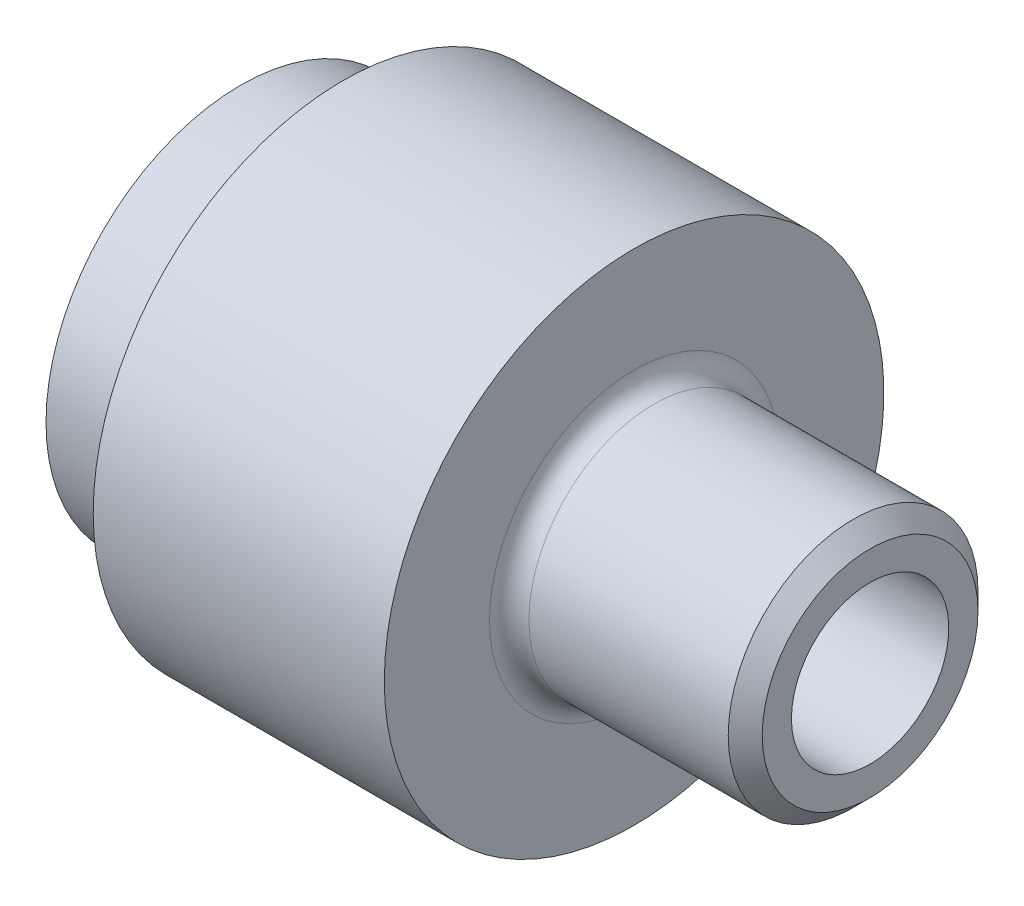
ISO-10303-21;
HEADER;
FILE_DESCRIPTION(('STEP AP214'),'2;1');
FILE_NAME('part.step','',(''),(''),'','','');
FILE_SCHEMA(('AUTOMOTIVE_DESIGN { 1 0 10303 214 1 1 1 1 }'));
ENDSEC;
DATA;
#1=APPLICATION_CONTEXT('core data for automotive mechanical design processes');
#2=APPLICATION_PROTOCOL_DEFINITION('international standard','automotive_design',2000,#1);
#3=PRODUCT_CONTEXT('',#1,'mechanical');
#4=PRODUCT('Part','Part','',(#3));
#5=PRODUCT_RELATED_PRODUCT_CATEGORY('part','',(#4));
#6=PRODUCT_DEFINITION_FORMATION('','',#4);
#7=PRODUCT_DEFINITION_CONTEXT('part definition',#1,'design');
#8=PRODUCT_DEFINITION('design','',#6,#7);
#9=PRODUCT_DEFINITION_SHAPE('','',#8);
#10=(LENGTH_UNIT() NAMED_UNIT(*) SI_UNIT(.MILLI.,.METRE.));
#11=(NAMED_UNIT(*) PLANE_ANGLE_UNIT() SI_UNIT($,.RADIAN.));
#12=(NAMED_UNIT(*) SI_UNIT($,.STERADIAN.) SOLID_ANGLE_UNIT());
#13=UNCERTAINTY_MEASURE_WITH_UNIT(LENGTH_MEASURE(1.E-05),#10,'distance_accuracy_value','');
#14=(GEOMETRIC_REPRESENTATION_CONTEXT(3) GLOBAL_UNCERTAINTY_ASSIGNED_CONTEXT((#13)) GLOBAL_UNIT_ASSIGNED_CONTEXT((#10,
#11,#12)) REPRESENTATION_CONTEXT('',''));
#15=CARTESIAN_POINT('',(0.,0.,0.));
#16=DIRECTION('',(0.,0.,1.));
#17=DIRECTION('',(1.,0.,0.));
#18=AXIS2_PLACEMENT_3D('',#15,#16,#17);
#19=CARTESIAN_POINT('',(39.195945945946,10.,0.));
#20=DIRECTION('',(-1.,0.,0.));
#21=DIRECTION('',(0.,0.,1.));
#22=AXIS2_PLACEMENT_3D('',#19,#20,#21);
#23=PLANE('',#22);
#24=CARTESIAN_POINT('',(39.195945945946,0.,0.));
#25=DIRECTION('',(-1.,0.,0.));
#26=DIRECTION('',(0.,0.,1.));
#27=AXIS2_PLACEMENT_3D('',#24,#25,#26);
#28=CIRCLE('',#27,10.);
#29=CARTESIAN_POINT('',(39.195945945946,0.,10.));
#30=VERTEX_POINT('',#29);
#31=EDGE_CURVE('E77',#30,#30,#28,.T.);
#32=ORIENTED_EDGE('',*,*,#31,.T.);
#33=EDGE_LOOP('',(#32));
#34=FACE_BOUND('',#33,.T.);
#35=CARTESIAN_POINT('',(39.195945945946,0.,0.));
#36=DIRECTION('',(-1.,0.,0.));
#37=DIRECTION('',(0.,0.,1.));
#38=AXIS2_PLACEMENT_3D('',#35,#36,#37);
#39=CIRCLE('',#38,13.71473);
#40=CARTESIAN_POINT('',(39.195945945946,0.,13.71473));
#41=VERTEX_POINT('',#40);
#42=EDGE_CURVE('E85',#41,#41,#39,.T.);
#43=ORIENTED_EDGE('',*,*,#42,.F.);
#44=EDGE_LOOP('',(#43));
#45=FACE_BOUND('',#44,.T.);
#46=ADVANCED_FACE('F45',(#34,#45),#23,.F.);
#47=CARTESIAN_POINT('',(-40.804054054054,10.,0.));
#48=DIRECTION('',(1.,0.,0.));
#49=DIRECTION('',(0.,0.,-1.));
#50=AXIS2_PLACEMENT_3D('',#47,#48,#49);
#51=PLANE('',#50);
#52=CARTESIAN_POINT('',(-40.804054054054,0.,0.));
#53=DIRECTION('',(-1.,0.,0.));
#54=DIRECTION('',(0.,0.,1.));
#55=AXIS2_PLACEMENT_3D('',#52,#53,#54);
#56=CIRCLE('',#55,10.);
#57=CARTESIAN_POINT('',(-40.804054054054,0.,10.));
#58=VERTEX_POINT('',#57);
#59=EDGE_CURVE('E81',#58,#58,#56,.T.);
#60=ORIENTED_EDGE('',*,*,#59,.F.);
#61=EDGE_LOOP('',(#60));
#62=FACE_BOUND('',#61,.T.);
#63=CARTESIAN_POINT('',(-40.804054054054,0.,0.));
#64=DIRECTION('',(-1.,0.,0.));
#65=DIRECTION('',(0.,0.,1.));
#66=AXIS2_PLACEMENT_3D('',#63,#64,#65);
#67=CIRCLE('',#66,24.75);
#68=CARTESIAN_POINT('',(-40.804054054054,0.,24.75));
#69=VERTEX_POINT('',#68);
#70=EDGE_CURVE('E10',#69,#69,#67,.T.);
#71=ORIENTED_EDGE('',*,*,#70,.T.);
#72=EDGE_LOOP('',(#71));
#73=FACE_BOUND('',#72,.T.);
#74=ADVANCED_FACE('F47',(#62,#73),#51,.F.);
#75=CARTESIAN_POINT('',(-48.5878378378378,0.,0.));
#76=DIRECTION('',(-1.,0.,0.));
#77=DIRECTION('',(0.,0.,1.));
#78=AXIS2_PLACEMENT_3D('',#75,#76,#77);
#79=CYLINDRICAL_SURFACE('',#78,24.75);
#80=ORIENTED_EDGE('',*,*,#70,.F.);
#81=EDGE_LOOP('',(#80));
#82=FACE_BOUND('',#81,.T.);
#83=CARTESIAN_POINT('',(-27.8040540540541,0.,0.));
#84=DIRECTION('',(-1.,0.,0.));
#85=DIRECTION('',(0.,0.,1.));
#86=AXIS2_PLACEMENT_3D('',#83,#84,#85);
#87=CIRCLE('',#86,24.75);
#88=CARTESIAN_POINT('',(-27.8040540540541,0.,24.75));
#89=VERTEX_POINT('',#88);
#90=EDGE_CURVE('E53',#89,#89,#87,.T.);
#91=ORIENTED_EDGE('',*,*,#90,.T.);
#92=EDGE_LOOP('',(#91));
#93=FACE_BOUND('',#92,.T.);
#94=ADVANCED_FACE('F109',(#82,#93),#79,.T.);
#95=CARTESIAN_POINT('',(-27.8040540540541,24.75,0.));
#96=DIRECTION('',(1.,0.,0.));
#97=DIRECTION('',(0.,0.,-1.));
#98=AXIS2_PLACEMENT_3D('',#95,#96,#97);
#99=PLANE('',#98);
#100=ORIENTED_EDGE('',*,*,#90,.F.);
#101=EDGE_LOOP('',(#100));
#102=FACE_BOUND('',#101,.T.);
#103=CARTESIAN_POINT('',(-27.8040540540541,0.,0.));
#104=DIRECTION('',(-1.,0.,0.));
#105=DIRECTION('',(0.,0.,1.));
#106=AXIS2_PLACEMENT_3D('',#103,#104,#105);
#107=CIRCLE('',#106,31.75);
#108=CARTESIAN_POINT('',(-27.8040540540541,0.,31.75));
#109=VERTEX_POINT('',#108);
#110=EDGE_CURVE('E58',#109,#109,#107,.T.);
#111=ORIENTED_EDGE('',*,*,#110,.T.);
#112=EDGE_LOOP('',(#111));
#113=FACE_BOUND('',#112,.T.);
#114=ADVANCED_FACE('F127',(#102,#113),#99,.F.);
#115=CARTESIAN_POINT('',(-48.5878378378378,0.,0.));
#116=DIRECTION('',(-1.,0.,0.));
#117=DIRECTION('',(0.,0.,1.));
#118=AXIS2_PLACEMENT_3D('',#115,#116,#117);
#119=CYLINDRICAL_SURFACE('',#118,31.75);
#120=ORIENTED_EDGE('',*,*,#110,.F.);
#121=EDGE_LOOP('',(#120));
#122=FACE_BOUND('',#121,.T.);
#123=CARTESIAN_POINT('',(9.19594594594595,0.,0.));
#124=DIRECTION('',(-1.,0.,0.));
#125=DIRECTION('',(0.,0.,1.));
#126=AXIS2_PLACEMENT_3D('',#123,#124,#125);
#127=CIRCLE('',#126,31.75);
#128=CARTESIAN_POINT('',(9.19594594594595,0.,31.75));
#129=VERTEX_POINT('',#128);
#130=EDGE_CURVE('E63',#129,#129,#127,.T.);
#131=ORIENTED_EDGE('',*,*,#130,.T.);
#132=EDGE_LOOP('',(#131));
#133=FACE_BOUND('',#132,.T.);
#134=ADVANCED_FACE('F123',(#122,#133),#119,.T.);
#135=CARTESIAN_POINT('',(9.19594594594595,18.375,0.));
#136=DIRECTION('',(-1.,0.,0.));
#137=DIRECTION('',(0.,0.,1.));
#138=AXIS2_PLACEMENT_3D('',#135,#136,#137);
#139=PLANE('',#138);
#140=ORIENTED_EDGE('',*,*,#130,.F.);
#141=EDGE_LOOP('',(#140));
#142=FACE_BOUND('',#141,.T.);
#143=CARTESIAN_POINT('',(9.19594594594596,0.,0.));
#144=DIRECTION('',(-1.,0.,0.));
#145=DIRECTION('',(0.,0.,1.));
#146=AXIS2_PLACEMENT_3D('',#143,#144,#145);
#147=CIRCLE('',#146,18.375);
#148=CARTESIAN_POINT('',(9.19594594594596,0.,18.375));
#149=VERTEX_POINT('',#148);
#150=EDGE_CURVE('E69',#149,#149,#147,.T.);
#151=ORIENTED_EDGE('',*,*,#150,.T.);
#152=EDGE_LOOP('',(#151));
#153=FACE_BOUND('',#152,.T.);
#154=ADVANCED_FACE('F119',(#142,#153),#139,.F.);
#155=CARTESIAN_POINT('',(11.695945945946,0.,0.));
#156=DIRECTION('',(-1.,0.,0.));
#157=DIRECTION('',(0.,0.,1.));
#158=AXIS2_PLACEMENT_3D('',#155,#156,#157);
#159=TOROIDAL_SURFACE('',#158,18.375,2.5);
#160=ORIENTED_EDGE('',*,*,#150,.F.);
#161=EDGE_LOOP('',(#160));
#162=FACE_BOUND('',#161,.T.);
#163=CARTESIAN_POINT('',(11.695945945946,0.,0.));
#164=DIRECTION('',(-1.,0.,0.));
#165=DIRECTION('',(0.,0.,1.));
#166=AXIS2_PLACEMENT_3D('',#163,#164,#165);
#167=CIRCLE('',#166,15.875);
#168=CARTESIAN_POINT('',(11.695945945946,0.,15.875));
#169=VERTEX_POINT('',#168);
#170=EDGE_CURVE('E73',#169,#169,#167,.T.);
#171=ORIENTED_EDGE('',*,*,#170,.T.);
#172=EDGE_LOOP('',(#171));
#173=FACE_BOUND('',#172,.T.);
#174=ADVANCED_FACE('F115',(#162,#173),#159,.F.);
#175=CARTESIAN_POINT('',(-48.5878378378378,0.,0.));
#176=DIRECTION('',(-1.,0.,0.));
#177=DIRECTION('',(0.,0.,1.));
#178=AXIS2_PLACEMENT_3D('',#175,#176,#177);
#179=CYLINDRICAL_SURFACE('',#178,15.875);
#180=ORIENTED_EDGE('',*,*,#170,.F.);
#181=EDGE_LOOP('',(#180));
#182=FACE_BOUND('',#181,.T.);
#183=CARTESIAN_POINT('',(37.035675945946,0.,0.));
#184=DIRECTION('',(-1.,0.,0.));
#185=DIRECTION('',(0.,0.,1.));
#186=AXIS2_PLACEMENT_3D('',#183,#184,#185);
#187=CIRCLE('',#186,15.875);
#188=CARTESIAN_POINT('',(37.035675945946,0.,15.875));
#189=VERTEX_POINT('',#188);
#190=EDGE_CURVE('E89',#189,#189,#187,.T.);
#191=ORIENTED_EDGE('',*,*,#190,.T.);
#192=EDGE_LOOP('',(#191));
#193=FACE_BOUND('',#192,.T.);
#194=ADVANCED_FACE('F94',(#182,#193),#179,.T.);
#195=CARTESIAN_POINT('',(-48.5878378378378,0.,0.));
#196=DIRECTION('',(-1.,0.,0.));
#197=DIRECTION('',(0.,0.,1.));
#198=AXIS2_PLACEMENT_3D('',#195,#196,#197);
#199=CYLINDRICAL_SURFACE('',#198,10.);
#200=ORIENTED_EDGE('',*,*,#31,.F.);
#201=EDGE_LOOP('',(#200));
#202=FACE_BOUND('',#201,.T.);
#203=ORIENTED_EDGE('',*,*,#59,.T.);
#204=EDGE_LOOP('',(#203));
#205=FACE_BOUND('',#204,.T.);
#206=ADVANCED_FACE('F99',(#202,#205),#199,.F.);
#207=CARTESIAN_POINT('',(39.195945945946,0.,0.));
#208=DIRECTION('',(-1.,0.,0.));
#209=DIRECTION('',(0.,0.,1.));
#210=AXIS2_PLACEMENT_3D('',#207,#208,#209);
#211=CONICAL_SURFACE('',#210,13.71473,0.785398163397448);
#212=ORIENTED_EDGE('',*,*,#190,.F.);
#213=EDGE_LOOP('',(#212));
#214=FACE_BOUND('',#213,.T.);
#215=ORIENTED_EDGE('',*,*,#42,.T.);
#216=EDGE_LOOP('',(#215));
#217=FACE_BOUND('',#216,.T.);
#218=ADVANCED_FACE('F96',(#214,#217),#211,.T.);
#219=CLOSED_SHELL('',(#46,#74,#94,#114,#134,#154,#174,#194,#206,#218));
#220=MANIFOLD_SOLID_BREP('B2',#219);
#221=ADVANCED_BREP_SHAPE_REPRESENTATION('',(#18,#220),#14);
#222=SHAPE_DEFINITION_REPRESENTATION(#9,#221);
ENDSEC;
END-ISO-10303-21;
